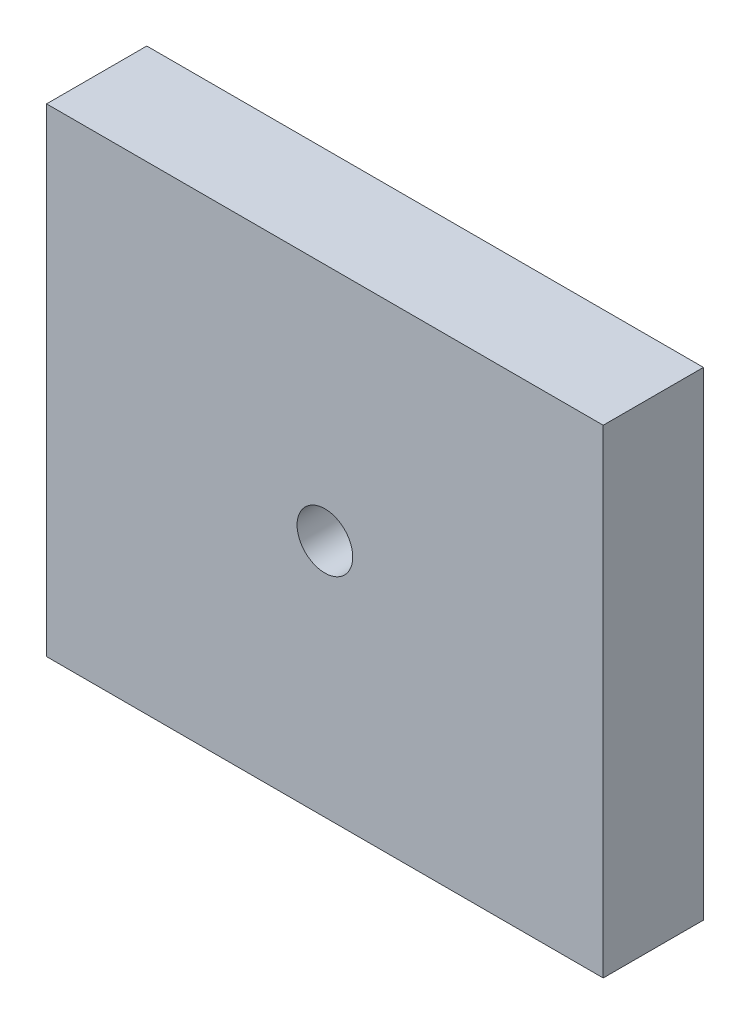
ISO-10303-21;
HEADER;
FILE_DESCRIPTION(('STEP AP214'),'2;1');
FILE_NAME('part.step','',(''),(''),'','','');
FILE_SCHEMA(('AUTOMOTIVE_DESIGN { 1 0 10303 214 1 1 1 1 }'));
ENDSEC;
DATA;
#1=APPLICATION_CONTEXT('core data for automotive mechanical design processes');
#2=APPLICATION_PROTOCOL_DEFINITION('international standard','automotive_design',2000,#1);
#3=PRODUCT_CONTEXT('',#1,'mechanical');
#4=PRODUCT('Part','Part','',(#3));
#5=PRODUCT_RELATED_PRODUCT_CATEGORY('part','',(#4));
#6=PRODUCT_DEFINITION_FORMATION('','',#4);
#7=PRODUCT_DEFINITION_CONTEXT('part definition',#1,'design');
#8=PRODUCT_DEFINITION('design','',#6,#7);
#9=PRODUCT_DEFINITION_SHAPE('','',#8);
#10=(LENGTH_UNIT() NAMED_UNIT(*) SI_UNIT(.MILLI.,.METRE.));
#11=(NAMED_UNIT(*) PLANE_ANGLE_UNIT() SI_UNIT($,.RADIAN.));
#12=(NAMED_UNIT(*) SI_UNIT($,.STERADIAN.) SOLID_ANGLE_UNIT());
#13=UNCERTAINTY_MEASURE_WITH_UNIT(LENGTH_MEASURE(1.E-05),#10,'distance_accuracy_value','');
#14=(GEOMETRIC_REPRESENTATION_CONTEXT(3) GLOBAL_UNCERTAINTY_ASSIGNED_CONTEXT((#13)) GLOBAL_UNIT_ASSIGNED_CONTEXT((#10,
#11,#12)) REPRESENTATION_CONTEXT('',''));
#15=CARTESIAN_POINT('',(0.,0.,0.));
#16=DIRECTION('',(0.,0.,1.));
#17=DIRECTION('',(1.,0.,0.));
#18=AXIS2_PLACEMENT_3D('',#15,#16,#17);
#19=CARTESIAN_POINT('',(0.,0.,9.));
#20=DIRECTION('',(1.,0.,0.));
#21=DIRECTION('',(0.,0.,-1.));
#22=AXIS2_PLACEMENT_3D('',#19,#20,#21);
#23=PLANE('',#22);
#24=DIRECTION('',(0.,-1.,0.));
#25=VECTOR('',#24,1.);
#26=CARTESIAN_POINT('',(0.,0.,0.));
#27=LINE('',#26,#25);
#28=CARTESIAN_POINT('',(0.,43.,0.));
#29=VERTEX_POINT('',#28);
#30=CARTESIAN_POINT('',(0.,0.,0.));
#31=VERTEX_POINT('',#30);
#32=EDGE_CURVE('E96',#29,#31,#27,.T.);
#33=ORIENTED_EDGE('',*,*,#32,.T.);
#34=DIRECTION('',(0.,0.,-1.));
#35=VECTOR('',#34,1.);
#36=CARTESIAN_POINT('',(0.,0.,9.));
#37=LINE('',#36,#35);
#38=CARTESIAN_POINT('',(0.,0.,9.));
#39=VERTEX_POINT('',#38);
#40=EDGE_CURVE('E11',#39,#31,#37,.T.);
#41=ORIENTED_EDGE('',*,*,#40,.F.);
#42=DIRECTION('',(0.,-1.,0.));
#43=VECTOR('',#42,1.);
#44=CARTESIAN_POINT('',(0.,0.,9.));
#45=LINE('',#44,#43);
#46=CARTESIAN_POINT('',(0.,43.,9.));
#47=VERTEX_POINT('',#46);
#48=EDGE_CURVE('E84',#47,#39,#45,.T.);
#49=ORIENTED_EDGE('',*,*,#48,.F.);
#50=DIRECTION('',(0.,0.,-1.));
#51=VECTOR('',#50,1.);
#52=CARTESIAN_POINT('',(0.,43.,9.));
#53=LINE('',#52,#51);
#54=EDGE_CURVE('E92',#47,#29,#53,.T.);
#55=ORIENTED_EDGE('',*,*,#54,.T.);
#56=EDGE_LOOP('',(#33,#41,#49,#55));
#57=FACE_BOUND('',#56,.T.);
#58=ADVANCED_FACE('F33',(#57),#23,.F.);
#59=CARTESIAN_POINT('',(0.,0.,9.));
#60=DIRECTION('',(0.,1.,0.));
#61=DIRECTION('',(0.,0.,1.));
#62=AXIS2_PLACEMENT_3D('',#59,#60,#61);
#63=PLANE('',#62);
#64=DIRECTION('',(1.,0.,0.));
#65=VECTOR('',#64,1.);
#66=CARTESIAN_POINT('',(0.,0.,0.));
#67=LINE('',#66,#65);
#68=CARTESIAN_POINT('',(50.,0.,0.));
#69=VERTEX_POINT('',#68);
#70=EDGE_CURVE('E88',#31,#69,#67,.T.);
#71=ORIENTED_EDGE('',*,*,#70,.T.);
#72=DIRECTION('',(0.,0.,-1.));
#73=VECTOR('',#72,1.);
#74=CARTESIAN_POINT('',(50.,0.,9.));
#75=LINE('',#74,#73);
#76=CARTESIAN_POINT('',(50.,0.,9.));
#77=VERTEX_POINT('',#76);
#78=EDGE_CURVE('E41',#77,#69,#75,.T.);
#79=ORIENTED_EDGE('',*,*,#78,.F.);
#80=DIRECTION('',(1.,0.,0.));
#81=VECTOR('',#80,1.);
#82=CARTESIAN_POINT('',(0.,0.,9.));
#83=LINE('',#82,#81);
#84=EDGE_CURVE('E79',#39,#77,#83,.T.);
#85=ORIENTED_EDGE('',*,*,#84,.F.);
#86=ORIENTED_EDGE('',*,*,#40,.T.);
#87=EDGE_LOOP('',(#71,#79,#85,#86));
#88=FACE_BOUND('',#87,.T.);
#89=ADVANCED_FACE('F87',(#88),#63,.F.);
#90=CARTESIAN_POINT('',(50.,0.,9.));
#91=DIRECTION('',(-1.,0.,0.));
#92=DIRECTION('',(0.,0.,1.));
#93=AXIS2_PLACEMENT_3D('',#90,#91,#92);
#94=PLANE('',#93);
#95=DIRECTION('',(0.,1.,0.));
#96=VECTOR('',#95,1.);
#97=CARTESIAN_POINT('',(50.,0.,0.));
#98=LINE('',#97,#96);
#99=CARTESIAN_POINT('',(50.,43.,0.));
#100=VERTEX_POINT('',#99);
#101=EDGE_CURVE('E66',#69,#100,#98,.T.);
#102=ORIENTED_EDGE('',*,*,#101,.T.);
#103=DIRECTION('',(0.,0.,-1.));
#104=VECTOR('',#103,1.);
#105=CARTESIAN_POINT('',(50.,43.,9.));
#106=LINE('',#105,#104);
#107=CARTESIAN_POINT('',(50.,43.,9.));
#108=VERTEX_POINT('',#107);
#109=EDGE_CURVE('E89',#108,#100,#106,.T.);
#110=ORIENTED_EDGE('',*,*,#109,.F.);
#111=DIRECTION('',(0.,1.,0.));
#112=VECTOR('',#111,1.);
#113=CARTESIAN_POINT('',(50.,0.,9.));
#114=LINE('',#113,#112);
#115=EDGE_CURVE('E82',#77,#108,#114,.T.);
#116=ORIENTED_EDGE('',*,*,#115,.F.);
#117=ORIENTED_EDGE('',*,*,#78,.T.);
#118=EDGE_LOOP('',(#102,#110,#116,#117));
#119=FACE_BOUND('',#118,.T.);
#120=ADVANCED_FACE('F90',(#119),#94,.F.);
#121=CARTESIAN_POINT('',(0.,43.,9.));
#122=DIRECTION('',(0.,-1.,0.));
#123=DIRECTION('',(0.,0.,-1.));
#124=AXIS2_PLACEMENT_3D('',#121,#122,#123);
#125=PLANE('',#124);
#126=DIRECTION('',(-1.,0.,0.));
#127=VECTOR('',#126,1.);
#128=CARTESIAN_POINT('',(0.,43.,0.));
#129=LINE('',#128,#127);
#130=EDGE_CURVE('E72',#100,#29,#129,.T.);
#131=ORIENTED_EDGE('',*,*,#130,.T.);
#132=ORIENTED_EDGE('',*,*,#54,.F.);
#133=DIRECTION('',(-1.,0.,0.));
#134=VECTOR('',#133,1.);
#135=CARTESIAN_POINT('',(0.,43.,9.));
#136=LINE('',#135,#134);
#137=EDGE_CURVE('E49',#108,#47,#136,.T.);
#138=ORIENTED_EDGE('',*,*,#137,.F.);
#139=ORIENTED_EDGE('',*,*,#109,.T.);
#140=EDGE_LOOP('',(#131,#132,#138,#139));
#141=FACE_BOUND('',#140,.T.);
#142=ADVANCED_FACE('F104',(#141),#125,.F.);
#143=CARTESIAN_POINT('',(0.,0.,9.));
#144=DIRECTION('',(0.,0.,-1.));
#145=DIRECTION('',(-1.,0.,0.));
#146=AXIS2_PLACEMENT_3D('',#143,#144,#145);
#147=PLANE('',#146);
#148=CARTESIAN_POINT('',(25.,21.5,9.));
#149=DIRECTION('',(0.,0.,-1.));
#150=DIRECTION('',(-1.,0.,0.));
#151=AXIS2_PLACEMENT_3D('',#148,#149,#150);
#152=CIRCLE('',#151,2.5);
#153=CARTESIAN_POINT('',(22.5,21.5,9.));
#154=VERTEX_POINT('',#153);
#155=EDGE_CURVE('E99',#154,#154,#152,.T.);
#156=ORIENTED_EDGE('',*,*,#155,.T.);
#157=EDGE_LOOP('',(#156));
#158=FACE_BOUND('',#157,.T.);
#159=ORIENTED_EDGE('',*,*,#48,.T.);
#160=ORIENTED_EDGE('',*,*,#84,.T.);
#161=ORIENTED_EDGE('',*,*,#115,.T.);
#162=ORIENTED_EDGE('',*,*,#137,.T.);
#163=EDGE_LOOP('',(#159,#160,#161,#162));
#164=FACE_BOUND('',#163,.T.);
#165=ADVANCED_FACE('F80',(#158,#164),#147,.F.);
#166=CARTESIAN_POINT('',(0.,0.,0.));
#167=DIRECTION('',(0.,0.,-1.));
#168=DIRECTION('',(-1.,0.,0.));
#169=AXIS2_PLACEMENT_3D('',#166,#167,#168);
#170=PLANE('',#169);
#171=CARTESIAN_POINT('',(25.,21.5,0.));
#172=DIRECTION('',(0.,0.,1.));
#173=DIRECTION('',(1.,0.,0.));
#174=AXIS2_PLACEMENT_3D('',#171,#172,#173);
#175=CIRCLE('',#174,2.5);
#176=CARTESIAN_POINT('',(27.5,21.5,0.));
#177=VERTEX_POINT('',#176);
#178=EDGE_CURVE('E112',#177,#177,#175,.T.);
#179=ORIENTED_EDGE('',*,*,#178,.T.);
#180=EDGE_LOOP('',(#179));
#181=FACE_BOUND('',#180,.T.);
#182=ORIENTED_EDGE('',*,*,#32,.F.);
#183=ORIENTED_EDGE('',*,*,#130,.F.);
#184=ORIENTED_EDGE('',*,*,#101,.F.);
#185=ORIENTED_EDGE('',*,*,#70,.F.);
#186=EDGE_LOOP('',(#182,#183,#184,#185));
#187=FACE_BOUND('',#186,.T.);
#188=ADVANCED_FACE('F107',(#181,#187),#170,.T.);
#189=CARTESIAN_POINT('',(25.,21.5,0.));
#190=DIRECTION('',(0.,0.,1.));
#191=DIRECTION('',(1.,0.,0.));
#192=AXIS2_PLACEMENT_3D('',#189,#190,#191);
#193=CYLINDRICAL_SURFACE('',#192,2.5);
#194=ORIENTED_EDGE('',*,*,#178,.F.);
#195=EDGE_LOOP('',(#194));
#196=FACE_BOUND('',#195,.T.);
#197=ORIENTED_EDGE('',*,*,#155,.F.);
#198=EDGE_LOOP('',(#197));
#199=FACE_BOUND('',#198,.T.);
#200=ADVANCED_FACE('F117',(#196,#199),#193,.F.);
#201=CLOSED_SHELL('',(#58,#89,#120,#142,#165,#188,#200));
#202=MANIFOLD_SOLID_BREP('B2',#201);
#203=ADVANCED_BREP_SHAPE_REPRESENTATION('',(#18,#202),#14);
#204=SHAPE_DEFINITION_REPRESENTATION(#9,#203);
ENDSEC;
END-ISO-10303-21;
